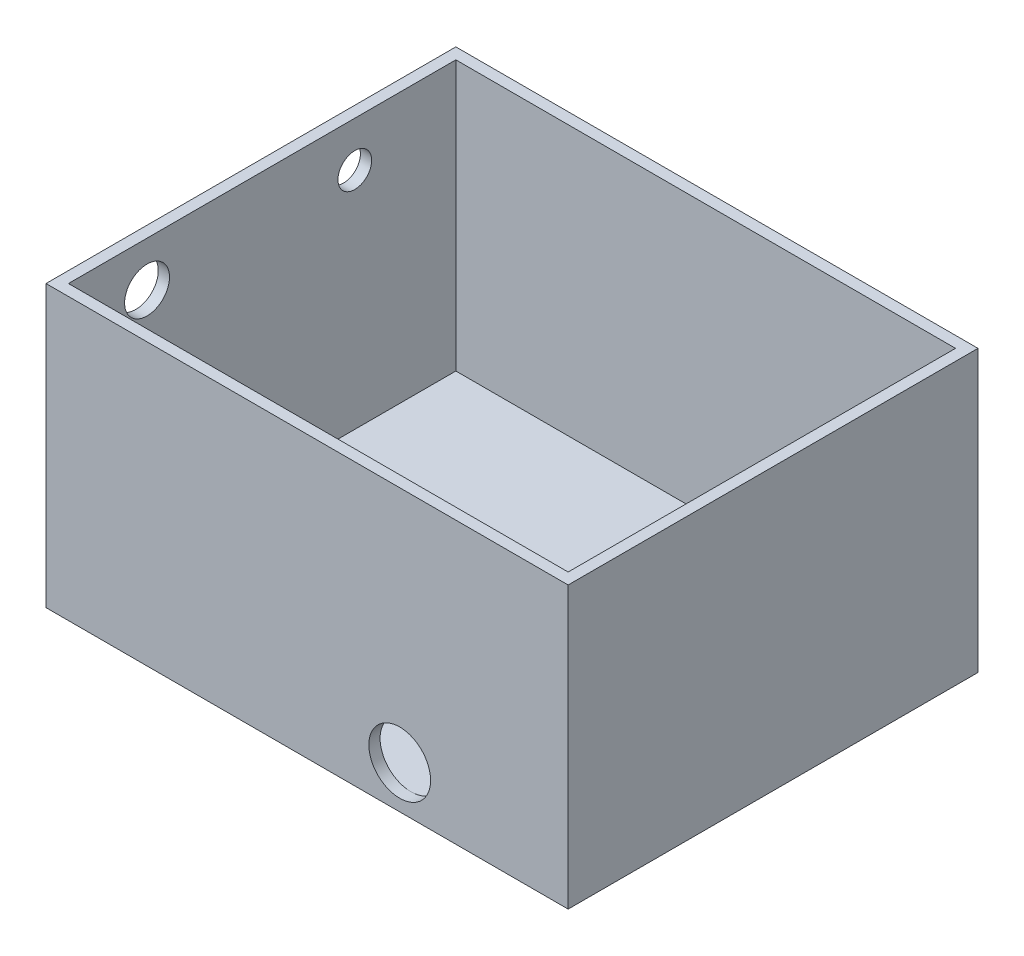
ISO-10303-21;
HEADER;
FILE_DESCRIPTION(('STEP AP214'),'2;1');
FILE_NAME('part.step','',(''),(''),'','','');
FILE_SCHEMA(('AUTOMOTIVE_DESIGN { 1 0 10303 214 1 1 1 1 }'));
ENDSEC;
DATA;
#1=APPLICATION_CONTEXT('core data for automotive mechanical design processes');
#2=APPLICATION_PROTOCOL_DEFINITION('international standard','automotive_design',2000,#1);
#3=PRODUCT_CONTEXT('',#1,'mechanical');
#4=PRODUCT('Part','Part','',(#3));
#5=PRODUCT_RELATED_PRODUCT_CATEGORY('part','',(#4));
#6=PRODUCT_DEFINITION_FORMATION('','',#4);
#7=PRODUCT_DEFINITION_CONTEXT('part definition',#1,'design');
#8=PRODUCT_DEFINITION('design','',#6,#7);
#9=PRODUCT_DEFINITION_SHAPE('','',#8);
#10=(LENGTH_UNIT() NAMED_UNIT(*) SI_UNIT(.MILLI.,.METRE.));
#11=(NAMED_UNIT(*) PLANE_ANGLE_UNIT() SI_UNIT($,.RADIAN.));
#12=(NAMED_UNIT(*) SI_UNIT($,.STERADIAN.) SOLID_ANGLE_UNIT());
#13=UNCERTAINTY_MEASURE_WITH_UNIT(LENGTH_MEASURE(1.E-05),#10,'distance_accuracy_value','');
#14=(GEOMETRIC_REPRESENTATION_CONTEXT(3) GLOBAL_UNCERTAINTY_ASSIGNED_CONTEXT((#13)) GLOBAL_UNIT_ASSIGNED_CONTEXT((#10,
#11,#12)) REPRESENTATION_CONTEXT('',''));
#15=CARTESIAN_POINT('',(0.,0.,0.));
#16=DIRECTION('',(0.,0.,1.));
#17=DIRECTION('',(1.,0.,0.));
#18=AXIS2_PLACEMENT_3D('',#15,#16,#17);
#19=CARTESIAN_POINT('',(59.055,63.5,-46.355));
#20=DIRECTION('',(-1.,0.,0.));
#21=DIRECTION('',(0.,0.,1.));
#22=AXIS2_PLACEMENT_3D('',#19,#20,#21);
#23=PLANE('',#22);
#24=DIRECTION('',(0.,0.,-1.));
#25=VECTOR('',#24,1.);
#26=CARTESIAN_POINT('',(59.055,0.,-46.355));
#27=LINE('',#26,#25);
#28=CARTESIAN_POINT('',(59.055,0.,46.355));
#29=VERTEX_POINT('',#28);
#30=CARTESIAN_POINT('',(59.055,0.,-46.355));
#31=VERTEX_POINT('',#30);
#32=EDGE_CURVE('E148',#29,#31,#27,.T.);
#33=ORIENTED_EDGE('',*,*,#32,.T.);
#34=DIRECTION('',(0.,-1.,0.));
#35=VECTOR('',#34,1.);
#36=CARTESIAN_POINT('',(59.055,63.5,-46.355));
#37=LINE('',#36,#35);
#38=CARTESIAN_POINT('',(59.055,63.5,-46.355));
#39=VERTEX_POINT('',#38);
#40=EDGE_CURVE('E11',#39,#31,#37,.T.);
#41=ORIENTED_EDGE('',*,*,#40,.F.);
#42=DIRECTION('',(0.,0.,-1.));
#43=VECTOR('',#42,1.);
#44=CARTESIAN_POINT('',(59.055,63.5,-46.355));
#45=LINE('',#44,#43);
#46=CARTESIAN_POINT('',(59.055,63.5,46.355));
#47=VERTEX_POINT('',#46);
#48=EDGE_CURVE('E141',#47,#39,#45,.T.);
#49=ORIENTED_EDGE('',*,*,#48,.F.);
#50=DIRECTION('',(0.,-1.,0.));
#51=VECTOR('',#50,1.);
#52=CARTESIAN_POINT('',(59.055,63.5,46.355));
#53=LINE('',#52,#51);
#54=EDGE_CURVE('E147',#47,#29,#53,.T.);
#55=ORIENTED_EDGE('',*,*,#54,.T.);
#56=EDGE_LOOP('',(#33,#41,#49,#55));
#57=FACE_BOUND('',#56,.T.);
#58=ADVANCED_FACE('F33',(#57),#23,.F.);
#59=CARTESIAN_POINT('',(-59.055,63.5,-46.355));
#60=DIRECTION('',(0.,0.,1.));
#61=DIRECTION('',(1.,0.,0.));
#62=AXIS2_PLACEMENT_3D('',#59,#60,#61);
#63=PLANE('',#62);
#64=DIRECTION('',(-1.,0.,0.));
#65=VECTOR('',#64,1.);
#66=CARTESIAN_POINT('',(-59.055,0.,-46.355));
#67=LINE('',#66,#65);
#68=CARTESIAN_POINT('',(-59.055,0.,-46.355));
#69=VERTEX_POINT('',#68);
#70=EDGE_CURVE('E151',#31,#69,#67,.T.);
#71=ORIENTED_EDGE('',*,*,#70,.T.);
#72=DIRECTION('',(0.,-1.,0.));
#73=VECTOR('',#72,1.);
#74=CARTESIAN_POINT('',(-59.055,63.5,-46.355));
#75=LINE('',#74,#73);
#76=CARTESIAN_POINT('',(-59.055,63.5,-46.355));
#77=VERTEX_POINT('',#76);
#78=EDGE_CURVE('E41',#77,#69,#75,.T.);
#79=ORIENTED_EDGE('',*,*,#78,.F.);
#80=DIRECTION('',(-1.,0.,0.));
#81=VECTOR('',#80,1.);
#82=CARTESIAN_POINT('',(-59.055,63.5,-46.355));
#83=LINE('',#82,#81);
#84=EDGE_CURVE('E85',#39,#77,#83,.T.);
#85=ORIENTED_EDGE('',*,*,#84,.F.);
#86=ORIENTED_EDGE('',*,*,#40,.T.);
#87=EDGE_LOOP('',(#71,#79,#85,#86));
#88=FACE_BOUND('',#87,.T.);
#89=ADVANCED_FACE('F182',(#88),#63,.F.);
#90=CARTESIAN_POINT('',(-59.055,63.5,-46.355));
#91=DIRECTION('',(1.,0.,0.));
#92=DIRECTION('',(0.,0.,-1.));
#93=AXIS2_PLACEMENT_3D('',#90,#91,#92);
#94=PLANE('',#93);
#95=CARTESIAN_POINT('',(-59.055,53.34,-20.955));
#96=DIRECTION('',(-1.,0.,0.));
#97=DIRECTION('',(0.,0.,1.));
#98=AXIS2_PLACEMENT_3D('',#95,#96,#97);
#99=CIRCLE('',#98,3.81);
#100=CARTESIAN_POINT('',(-59.055,53.34,-17.145));
#101=VERTEX_POINT('',#100);
#102=EDGE_CURVE('E303',#101,#101,#99,.T.);
#103=ORIENTED_EDGE('',*,*,#102,.F.);
#104=EDGE_LOOP('',(#103));
#105=FACE_BOUND('',#104,.T.);
#106=CARTESIAN_POINT('',(-59.055,53.34,26.035));
#107=DIRECTION('',(-1.,0.,0.));
#108=DIRECTION('',(0.,0.,1.));
#109=AXIS2_PLACEMENT_3D('',#106,#107,#108);
#110=CIRCLE('',#109,5.08);
#111=CARTESIAN_POINT('',(-59.055,53.34,31.115));
#112=VERTEX_POINT('',#111);
#113=EDGE_CURVE('E299',#112,#112,#110,.T.);
#114=ORIENTED_EDGE('',*,*,#113,.F.);
#115=EDGE_LOOP('',(#114));
#116=FACE_BOUND('',#115,.T.);
#117=DIRECTION('',(0.,0.,1.));
#118=VECTOR('',#117,1.);
#119=CARTESIAN_POINT('',(-59.055,0.,-46.355));
#120=LINE('',#119,#118);
#121=CARTESIAN_POINT('',(-59.055,0.,46.355));
#122=VERTEX_POINT('',#121);
#123=EDGE_CURVE('E153',#69,#122,#120,.T.);
#124=ORIENTED_EDGE('',*,*,#123,.T.);
#125=DIRECTION('',(0.,-1.,0.));
#126=VECTOR('',#125,1.);
#127=CARTESIAN_POINT('',(-59.055,63.5,46.355));
#128=LINE('',#127,#126);
#129=CARTESIAN_POINT('',(-59.055,63.5,46.355));
#130=VERTEX_POINT('',#129);
#131=EDGE_CURVE('E157',#130,#122,#128,.T.);
#132=ORIENTED_EDGE('',*,*,#131,.F.);
#133=DIRECTION('',(0.,0.,1.));
#134=VECTOR('',#133,1.);
#135=CARTESIAN_POINT('',(-59.055,63.5,-46.355));
#136=LINE('',#135,#134);
#137=EDGE_CURVE('E144',#77,#130,#136,.T.);
#138=ORIENTED_EDGE('',*,*,#137,.F.);
#139=ORIENTED_EDGE('',*,*,#78,.T.);
#140=EDGE_LOOP('',(#124,#132,#138,#139));
#141=FACE_BOUND('',#140,.T.);
#142=ADVANCED_FACE('F163',(#105,#116,#141),#94,.F.);
#143=CARTESIAN_POINT('',(-59.055,63.5,46.355));
#144=DIRECTION('',(0.,0.,-1.));
#145=DIRECTION('',(-1.,0.,0.));
#146=AXIS2_PLACEMENT_3D('',#143,#144,#145);
#147=PLANE('',#146);
#148=CARTESIAN_POINT('',(20.955,9.652,46.355));
#149=DIRECTION('',(0.,0.,1.));
#150=DIRECTION('',(1.,0.,0.));
#151=AXIS2_PLACEMENT_3D('',#148,#149,#150);
#152=CIRCLE('',#151,6.985);
#153=CARTESIAN_POINT('',(27.94,9.652,46.355));
#154=VERTEX_POINT('',#153);
#155=EDGE_CURVE('E292',#154,#154,#152,.T.);
#156=ORIENTED_EDGE('',*,*,#155,.F.);
#157=EDGE_LOOP('',(#156));
#158=FACE_BOUND('',#157,.T.);
#159=DIRECTION('',(1.,0.,0.));
#160=VECTOR('',#159,1.);
#161=CARTESIAN_POINT('',(-59.055,0.,46.355));
#162=LINE('',#161,#160);
#163=EDGE_CURVE('E78',#122,#29,#162,.T.);
#164=ORIENTED_EDGE('',*,*,#163,.T.);
#165=ORIENTED_EDGE('',*,*,#54,.F.);
#166=DIRECTION('',(1.,0.,0.));
#167=VECTOR('',#166,1.);
#168=CARTESIAN_POINT('',(-59.055,63.5,46.355));
#169=LINE('',#168,#167);
#170=EDGE_CURVE('E57',#130,#47,#169,.T.);
#171=ORIENTED_EDGE('',*,*,#170,.F.);
#172=ORIENTED_EDGE('',*,*,#131,.T.);
#173=EDGE_LOOP('',(#164,#165,#171,#172));
#174=FACE_BOUND('',#173,.T.);
#175=ADVANCED_FACE('F171',(#158,#174),#147,.F.);
#176=CARTESIAN_POINT('',(0.,63.5,0.));
#177=DIRECTION('',(0.,1.,0.));
#178=DIRECTION('',(0.,0.,1.));
#179=AXIS2_PLACEMENT_3D('',#176,#177,#178);
#180=PLANE('',#179);
#181=DIRECTION('',(0.,0.,-1.));
#182=VECTOR('',#181,1.);
#183=CARTESIAN_POINT('',(56.515,63.5,-46.355));
#184=LINE('',#183,#182);
#185=CARTESIAN_POINT('',(56.515,63.5,43.815));
#186=VERTEX_POINT('',#185);
#187=CARTESIAN_POINT('',(56.515,63.5,-43.815));
#188=VERTEX_POINT('',#187);
#189=EDGE_CURVE('E130',#186,#188,#184,.T.);
#190=ORIENTED_EDGE('',*,*,#189,.F.);
#191=DIRECTION('',(1.,0.,0.));
#192=VECTOR('',#191,1.);
#193=CARTESIAN_POINT('',(-59.055,63.5,43.815));
#194=LINE('',#193,#192);
#195=CARTESIAN_POINT('',(-56.515,63.5,43.815));
#196=VERTEX_POINT('',#195);
#197=EDGE_CURVE('E139',#196,#186,#194,.T.);
#198=ORIENTED_EDGE('',*,*,#197,.F.);
#199=DIRECTION('',(0.,0.,1.));
#200=VECTOR('',#199,1.);
#201=CARTESIAN_POINT('',(-56.515,63.5,-46.355));
#202=LINE('',#201,#200);
#203=CARTESIAN_POINT('',(-56.515,63.5,-43.815));
#204=VERTEX_POINT('',#203);
#205=EDGE_CURVE('E137',#204,#196,#202,.T.);
#206=ORIENTED_EDGE('',*,*,#205,.F.);
#207=DIRECTION('',(-1.,0.,0.));
#208=VECTOR('',#207,1.);
#209=CARTESIAN_POINT('',(-59.055,63.5,-43.815));
#210=LINE('',#209,#208);
#211=EDGE_CURVE('E122',#188,#204,#210,.T.);
#212=ORIENTED_EDGE('',*,*,#211,.F.);
#213=EDGE_LOOP('',(#190,#198,#206,#212));
#214=FACE_BOUND('',#213,.T.);
#215=ORIENTED_EDGE('',*,*,#48,.T.);
#216=ORIENTED_EDGE('',*,*,#84,.T.);
#217=ORIENTED_EDGE('',*,*,#137,.T.);
#218=ORIENTED_EDGE('',*,*,#170,.T.);
#219=EDGE_LOOP('',(#215,#216,#217,#218));
#220=FACE_BOUND('',#219,.T.);
#221=ADVANCED_FACE('F173',(#214,#220),#180,.T.);
#222=CARTESIAN_POINT('',(0.,0.,0.));
#223=DIRECTION('',(0.,1.,0.));
#224=DIRECTION('',(0.,0.,1.));
#225=AXIS2_PLACEMENT_3D('',#222,#223,#224);
#226=PLANE('',#225);
#227=ORIENTED_EDGE('',*,*,#32,.F.);
#228=ORIENTED_EDGE('',*,*,#163,.F.);
#229=ORIENTED_EDGE('',*,*,#123,.F.);
#230=ORIENTED_EDGE('',*,*,#70,.F.);
#231=EDGE_LOOP('',(#227,#228,#229,#230));
#232=FACE_BOUND('',#231,.T.);
#233=ADVANCED_FACE('F167',(#232),#226,.F.);
#234=CARTESIAN_POINT('',(56.515,63.5,-46.355));
#235=DIRECTION('',(-1.,0.,0.));
#236=DIRECTION('',(0.,0.,1.));
#237=AXIS2_PLACEMENT_3D('',#234,#235,#236);
#238=PLANE('',#237);
#239=DIRECTION('',(0.,0.,-1.));
#240=VECTOR('',#239,1.);
#241=CARTESIAN_POINT('',(56.515,2.54,-46.355));
#242=LINE('',#241,#240);
#243=CARTESIAN_POINT('',(56.515,2.54,43.815));
#244=VERTEX_POINT('',#243);
#245=CARTESIAN_POINT('',(56.515,2.54,-43.815));
#246=VERTEX_POINT('',#245);
#247=EDGE_CURVE('E113',#244,#246,#242,.T.);
#248=ORIENTED_EDGE('',*,*,#247,.F.);
#249=DIRECTION('',(0.,-1.,0.));
#250=VECTOR('',#249,1.);
#251=CARTESIAN_POINT('',(56.515,63.5,43.815));
#252=LINE('',#251,#250);
#253=EDGE_CURVE('E133',#186,#244,#252,.T.);
#254=ORIENTED_EDGE('',*,*,#253,.F.);
#255=ORIENTED_EDGE('',*,*,#189,.T.);
#256=DIRECTION('',(0.,-1.,0.));
#257=VECTOR('',#256,1.);
#258=CARTESIAN_POINT('',(56.515,63.5,-43.815));
#259=LINE('',#258,#257);
#260=EDGE_CURVE('E125',#188,#246,#259,.T.);
#261=ORIENTED_EDGE('',*,*,#260,.T.);
#262=EDGE_LOOP('',(#248,#254,#255,#261));
#263=FACE_BOUND('',#262,.T.);
#264=ADVANCED_FACE('F259',(#263),#238,.T.);
#265=CARTESIAN_POINT('',(-59.055,63.5,-43.815));
#266=DIRECTION('',(0.,0.,1.));
#267=DIRECTION('',(1.,0.,0.));
#268=AXIS2_PLACEMENT_3D('',#265,#266,#267);
#269=PLANE('',#268);
#270=DIRECTION('',(-1.,0.,0.));
#271=VECTOR('',#270,1.);
#272=CARTESIAN_POINT('',(-59.055,2.54,-43.815));
#273=LINE('',#272,#271);
#274=CARTESIAN_POINT('',(-56.515,2.54,-43.815));
#275=VERTEX_POINT('',#274);
#276=EDGE_CURVE('E107',#246,#275,#273,.T.);
#277=ORIENTED_EDGE('',*,*,#276,.F.);
#278=ORIENTED_EDGE('',*,*,#260,.F.);
#279=ORIENTED_EDGE('',*,*,#211,.T.);
#280=DIRECTION('',(0.,-1.,0.));
#281=VECTOR('',#280,1.);
#282=CARTESIAN_POINT('',(-56.515,63.5,-43.815));
#283=LINE('',#282,#281);
#284=EDGE_CURVE('E119',#204,#275,#283,.T.);
#285=ORIENTED_EDGE('',*,*,#284,.T.);
#286=EDGE_LOOP('',(#277,#278,#279,#285));
#287=FACE_BOUND('',#286,.T.);
#288=ADVANCED_FACE('F120',(#287),#269,.T.);
#289=CARTESIAN_POINT('',(-56.515,63.5,-46.355));
#290=DIRECTION('',(1.,0.,0.));
#291=DIRECTION('',(0.,0.,-1.));
#292=AXIS2_PLACEMENT_3D('',#289,#290,#291);
#293=PLANE('',#292);
#294=CARTESIAN_POINT('',(-56.515,53.34,-20.955));
#295=DIRECTION('',(1.,0.,0.));
#296=DIRECTION('',(0.,0.,-1.));
#297=AXIS2_PLACEMENT_3D('',#294,#295,#296);
#298=CIRCLE('',#297,3.81);
#299=CARTESIAN_POINT('',(-56.515,53.34,-24.765));
#300=VERTEX_POINT('',#299);
#301=EDGE_CURVE('E306',#300,#300,#298,.F.);
#302=ORIENTED_EDGE('',*,*,#301,.T.);
#303=EDGE_LOOP('',(#302));
#304=FACE_BOUND('',#303,.T.);
#305=CARTESIAN_POINT('',(-56.515,53.34,26.035));
#306=DIRECTION('',(1.,0.,0.));
#307=DIRECTION('',(0.,0.,-1.));
#308=AXIS2_PLACEMENT_3D('',#305,#306,#307);
#309=CIRCLE('',#308,5.08);
#310=CARTESIAN_POINT('',(-56.515,53.34,20.955));
#311=VERTEX_POINT('',#310);
#312=EDGE_CURVE('E300',#311,#311,#309,.F.);
#313=ORIENTED_EDGE('',*,*,#312,.T.);
#314=EDGE_LOOP('',(#313));
#315=FACE_BOUND('',#314,.T.);
#316=DIRECTION('',(0.,0.,1.));
#317=VECTOR('',#316,1.);
#318=CARTESIAN_POINT('',(-56.515,2.54,-46.355));
#319=LINE('',#318,#317);
#320=CARTESIAN_POINT('',(-56.515,2.54,43.815));
#321=VERTEX_POINT('',#320);
#322=EDGE_CURVE('E111',#275,#321,#319,.T.);
#323=ORIENTED_EDGE('',*,*,#322,.F.);
#324=ORIENTED_EDGE('',*,*,#284,.F.);
#325=ORIENTED_EDGE('',*,*,#205,.T.);
#326=DIRECTION('',(0.,-1.,0.));
#327=VECTOR('',#326,1.);
#328=CARTESIAN_POINT('',(-56.515,63.5,43.815));
#329=LINE('',#328,#327);
#330=EDGE_CURVE('E48',#196,#321,#329,.T.);
#331=ORIENTED_EDGE('',*,*,#330,.T.);
#332=EDGE_LOOP('',(#323,#324,#325,#331));
#333=FACE_BOUND('',#332,.T.);
#334=ADVANCED_FACE('F127',(#304,#315,#333),#293,.T.);
#335=CARTESIAN_POINT('',(-59.055,63.5,43.815));
#336=DIRECTION('',(0.,0.,-1.));
#337=DIRECTION('',(-1.,0.,0.));
#338=AXIS2_PLACEMENT_3D('',#335,#336,#337);
#339=PLANE('',#338);
#340=CARTESIAN_POINT('',(20.955,9.652,43.815));
#341=DIRECTION('',(0.,0.,-1.));
#342=DIRECTION('',(-1.,0.,0.));
#343=AXIS2_PLACEMENT_3D('',#340,#341,#342);
#344=CIRCLE('',#343,6.985);
#345=CARTESIAN_POINT('',(13.97,9.652,43.815));
#346=VERTEX_POINT('',#345);
#347=EDGE_CURVE('E36',#346,#346,#344,.T.);
#348=ORIENTED_EDGE('',*,*,#347,.F.);
#349=EDGE_LOOP('',(#348));
#350=FACE_BOUND('',#349,.T.);
#351=DIRECTION('',(1.,0.,0.));
#352=VECTOR('',#351,1.);
#353=CARTESIAN_POINT('',(-59.055,2.54,43.815));
#354=LINE('',#353,#352);
#355=EDGE_CURVE('E128',#321,#244,#354,.T.);
#356=ORIENTED_EDGE('',*,*,#355,.F.);
#357=ORIENTED_EDGE('',*,*,#330,.F.);
#358=ORIENTED_EDGE('',*,*,#197,.T.);
#359=ORIENTED_EDGE('',*,*,#253,.T.);
#360=EDGE_LOOP('',(#356,#357,#358,#359));
#361=FACE_BOUND('',#360,.T.);
#362=ADVANCED_FACE('F214',(#350,#361),#339,.T.);
#363=CARTESIAN_POINT('',(0.,2.54,0.));
#364=DIRECTION('',(0.,1.,0.));
#365=DIRECTION('',(0.,0.,1.));
#366=AXIS2_PLACEMENT_3D('',#363,#364,#365);
#367=PLANE('',#366);
#368=ORIENTED_EDGE('',*,*,#247,.T.);
#369=ORIENTED_EDGE('',*,*,#276,.T.);
#370=ORIENTED_EDGE('',*,*,#322,.T.);
#371=ORIENTED_EDGE('',*,*,#355,.T.);
#372=EDGE_LOOP('',(#368,#369,#370,#371));
#373=FACE_BOUND('',#372,.T.);
#374=ADVANCED_FACE('F109',(#373),#367,.T.);
#375=CARTESIAN_POINT('',(20.955,9.652,-63.5715634663521));
#376=DIRECTION('',(0.,0.,1.));
#377=DIRECTION('',(1.,0.,0.));
#378=AXIS2_PLACEMENT_3D('',#375,#376,#377);
#379=CYLINDRICAL_SURFACE('',#378,6.985);
#380=ORIENTED_EDGE('',*,*,#347,.T.);
#381=EDGE_LOOP('',(#380));
#382=FACE_BOUND('',#381,.T.);
#383=ORIENTED_EDGE('',*,*,#155,.T.);
#384=EDGE_LOOP('',(#383));
#385=FACE_BOUND('',#384,.T.);
#386=ADVANCED_FACE('F235',(#382,#385),#379,.F.);
#387=CARTESIAN_POINT('',(59.056,53.34,26.035));
#388=DIRECTION('',(-1.,0.,0.));
#389=DIRECTION('',(0.,0.,1.));
#390=AXIS2_PLACEMENT_3D('',#387,#388,#389);
#391=CYLINDRICAL_SURFACE('',#390,5.08);
#392=ORIENTED_EDGE('',*,*,#312,.F.);
#393=EDGE_LOOP('',(#392));
#394=FACE_BOUND('',#393,.T.);
#395=ORIENTED_EDGE('',*,*,#113,.T.);
#396=EDGE_LOOP('',(#395));
#397=FACE_BOUND('',#396,.T.);
#398=ADVANCED_FACE('F205',(#394,#397),#391,.F.);
#399=CARTESIAN_POINT('',(59.056,53.34,-20.955));
#400=DIRECTION('',(-1.,0.,0.));
#401=DIRECTION('',(0.,0.,1.));
#402=AXIS2_PLACEMENT_3D('',#399,#400,#401);
#403=CYLINDRICAL_SURFACE('',#402,3.81);
#404=ORIENTED_EDGE('',*,*,#301,.F.);
#405=EDGE_LOOP('',(#404));
#406=FACE_BOUND('',#405,.T.);
#407=ORIENTED_EDGE('',*,*,#102,.T.);
#408=EDGE_LOOP('',(#407));
#409=FACE_BOUND('',#408,.T.);
#410=ADVANCED_FACE('F224',(#406,#409),#403,.F.);
#411=CLOSED_SHELL('',(#58,#89,#142,#175,#221,#233,#264,#288,#334,#362,#374,#386,#398,#410));
#412=MANIFOLD_SOLID_BREP('B2',#411);
#413=ADVANCED_BREP_SHAPE_REPRESENTATION('',(#18,#412),#14);
#414=SHAPE_DEFINITION_REPRESENTATION(#9,#413);
ENDSEC;
END-ISO-10303-21;
